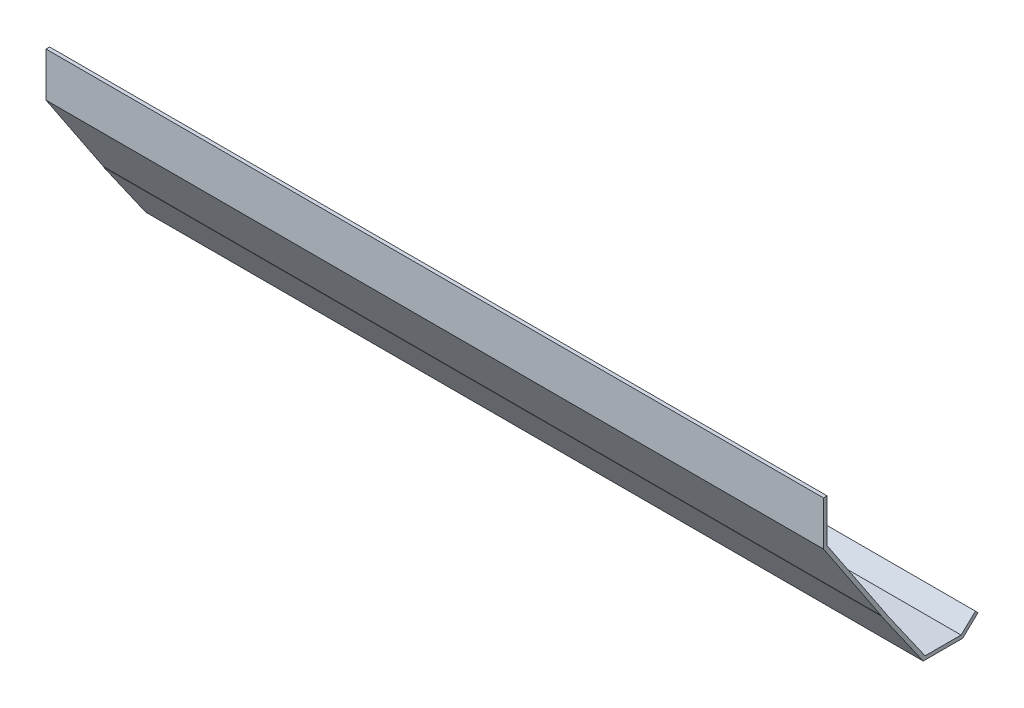
ISO-10303-21;
HEADER;
FILE_DESCRIPTION(('STEP AP214'),'2;1');
FILE_NAME('part.step','',(''),(''),'','','');
FILE_SCHEMA(('AUTOMOTIVE_DESIGN { 1 0 10303 214 1 1 1 1 }'));
ENDSEC;
DATA;
#1=APPLICATION_CONTEXT('core data for automotive mechanical design processes');
#2=APPLICATION_PROTOCOL_DEFINITION('international standard','automotive_design',2000,#1);
#3=PRODUCT_CONTEXT('',#1,'mechanical');
#4=PRODUCT('Part','Part','',(#3));
#5=PRODUCT_RELATED_PRODUCT_CATEGORY('part','',(#4));
#6=PRODUCT_DEFINITION_FORMATION('','',#4);
#7=PRODUCT_DEFINITION_CONTEXT('part definition',#1,'design');
#8=PRODUCT_DEFINITION('design','',#6,#7);
#9=PRODUCT_DEFINITION_SHAPE('','',#8);
#10=(LENGTH_UNIT() NAMED_UNIT(*) SI_UNIT(.MILLI.,.METRE.));
#11=(NAMED_UNIT(*) PLANE_ANGLE_UNIT() SI_UNIT($,.RADIAN.));
#12=(NAMED_UNIT(*) SI_UNIT($,.STERADIAN.) SOLID_ANGLE_UNIT());
#13=UNCERTAINTY_MEASURE_WITH_UNIT(LENGTH_MEASURE(1.E-05),#10,'distance_accuracy_value','');
#14=(GEOMETRIC_REPRESENTATION_CONTEXT(3) GLOBAL_UNCERTAINTY_ASSIGNED_CONTEXT((#13)) GLOBAL_UNIT_ASSIGNED_CONTEXT((#10,
#11,#12)) REPRESENTATION_CONTEXT('',''));
#15=CARTESIAN_POINT('',(0.,0.,0.));
#16=DIRECTION('',(0.,0.,1.));
#17=DIRECTION('',(1.,0.,0.));
#18=AXIS2_PLACEMENT_3D('',#15,#16,#17);
#19=CARTESIAN_POINT('',(685.8,0.,0.));
#20=DIRECTION('',(0.,-0.554700196225229,0.832050294337844));
#21=DIRECTION('',(0.,-0.832050294337844,-0.554700196225229));
#22=AXIS2_PLACEMENT_3D('',#19,#20,#21);
#23=PLANE('',#22);
#24=DIRECTION('',(0.,0.832050294337844,0.554700196225229));
#25=VECTOR('',#24,1.);
#26=CARTESIAN_POINT('',(0.,0.,0.));
#27=LINE('',#26,#25);
#28=CARTESIAN_POINT('',(0.,0.,0.));
#29=VERTEX_POINT('',#28);
#30=CARTESIAN_POINT('',(0.,76.2,50.8));
#31=VERTEX_POINT('',#30);
#32=EDGE_CURVE('E165',#29,#31,#27,.T.);
#33=ORIENTED_EDGE('',*,*,#32,.T.);
#34=DIRECTION('',(-1.,0.,0.));
#35=VECTOR('',#34,1.);
#36=CARTESIAN_POINT('',(685.8,76.2,50.8));
#37=LINE('',#36,#35);
#38=CARTESIAN_POINT('',(685.8,76.2,50.8));
#39=VERTEX_POINT('',#38);
#40=EDGE_CURVE('E11',#39,#31,#37,.T.);
#41=ORIENTED_EDGE('',*,*,#40,.F.);
#42=DIRECTION('',(0.,0.832050294337844,0.554700196225229));
#43=VECTOR('',#42,1.);
#44=CARTESIAN_POINT('',(685.8,0.,0.));
#45=LINE('',#44,#43);
#46=CARTESIAN_POINT('',(685.8,0.,0.));
#47=VERTEX_POINT('',#46);
#48=EDGE_CURVE('E191',#47,#39,#45,.T.);
#49=ORIENTED_EDGE('',*,*,#48,.F.);
#50=DIRECTION('',(-1.,0.,0.));
#51=VECTOR('',#50,1.);
#52=CARTESIAN_POINT('',(685.8,0.,0.));
#53=LINE('',#52,#51);
#54=EDGE_CURVE('E161',#47,#29,#53,.T.);
#55=ORIENTED_EDGE('',*,*,#54,.T.);
#56=EDGE_LOOP('',(#33,#41,#49,#55));
#57=FACE_BOUND('',#56,.T.);
#58=ADVANCED_FACE('F33',(#57),#23,.F.);
#59=CARTESIAN_POINT('',(685.8,76.2,50.8));
#60=DIRECTION('',(0.,0.,1.));
#61=DIRECTION('',(1.,0.,0.));
#62=AXIS2_PLACEMENT_3D('',#59,#60,#61);
#63=PLANE('',#62);
#64=DIRECTION('',(0.,1.,0.));
#65=VECTOR('',#64,1.);
#66=CARTESIAN_POINT('',(0.,76.2,50.8));
#67=LINE('',#66,#65);
#68=CARTESIAN_POINT('',(0.,114.3,50.8));
#69=VERTEX_POINT('',#68);
#70=EDGE_CURVE('E168',#31,#69,#67,.T.);
#71=ORIENTED_EDGE('',*,*,#70,.T.);
#72=DIRECTION('',(-1.,0.,0.));
#73=VECTOR('',#72,1.);
#74=CARTESIAN_POINT('',(685.8,114.3,50.8));
#75=LINE('',#74,#73);
#76=CARTESIAN_POINT('',(685.8,114.3,50.8));
#77=VERTEX_POINT('',#76);
#78=EDGE_CURVE('E41',#77,#69,#75,.T.);
#79=ORIENTED_EDGE('',*,*,#78,.F.);
#80=DIRECTION('',(0.,1.,0.));
#81=VECTOR('',#80,1.);
#82=CARTESIAN_POINT('',(685.8,76.2,50.8));
#83=LINE('',#82,#81);
#84=EDGE_CURVE('E110',#39,#77,#83,.T.);
#85=ORIENTED_EDGE('',*,*,#84,.F.);
#86=ORIENTED_EDGE('',*,*,#40,.T.);
#87=EDGE_LOOP('',(#71,#79,#85,#86));
#88=FACE_BOUND('',#87,.T.);
#89=ADVANCED_FACE('F279',(#88),#63,.F.);
#90=CARTESIAN_POINT('',(685.8,114.3,50.8));
#91=DIRECTION('',(0.,-1.,0.));
#92=DIRECTION('',(0.,0.,-1.));
#93=AXIS2_PLACEMENT_3D('',#90,#91,#92);
#94=PLANE('',#93);
#95=DIRECTION('',(0.,0.,1.));
#96=VECTOR('',#95,1.);
#97=CARTESIAN_POINT('',(0.,114.3,50.8));
#98=LINE('',#97,#96);
#99=CARTESIAN_POINT('',(0.,114.3,53.975));
#100=VERTEX_POINT('',#99);
#101=EDGE_CURVE('E170',#69,#100,#98,.T.);
#102=ORIENTED_EDGE('',*,*,#101,.T.);
#103=DIRECTION('',(-1.,0.,0.));
#104=VECTOR('',#103,1.);
#105=CARTESIAN_POINT('',(685.8,114.3,53.975));
#106=LINE('',#105,#104);
#107=CARTESIAN_POINT('',(685.8,114.3,53.975));
#108=VERTEX_POINT('',#107);
#109=EDGE_CURVE('E216',#108,#100,#106,.T.);
#110=ORIENTED_EDGE('',*,*,#109,.F.);
#111=DIRECTION('',(0.,0.,1.));
#112=VECTOR('',#111,1.);
#113=CARTESIAN_POINT('',(685.8,114.3,50.8));
#114=LINE('',#113,#112);
#115=EDGE_CURVE('E224',#77,#108,#114,.T.);
#116=ORIENTED_EDGE('',*,*,#115,.F.);
#117=ORIENTED_EDGE('',*,*,#78,.T.);
#118=EDGE_LOOP('',(#102,#110,#116,#117));
#119=FACE_BOUND('',#118,.T.);
#120=ADVANCED_FACE('F222',(#119),#94,.F.);
#121=CARTESIAN_POINT('',(685.8,114.3,53.975));
#122=DIRECTION('',(0.,0.,-1.));
#123=DIRECTION('',(0.,1.,0.));
#124=AXIS2_PLACEMENT_3D('',#121,#122,#123);
#125=PLANE('',#124);
#126=DIRECTION('',(0.,-1.,0.));
#127=VECTOR('',#126,1.);
#128=CARTESIAN_POINT('',(0.,114.3,53.975));
#129=LINE('',#128,#127);
#130=CARTESIAN_POINT('',(0.,75.2386873502009,53.975));
#131=VERTEX_POINT('',#130);
#132=EDGE_CURVE('E172',#100,#131,#129,.T.);
#133=ORIENTED_EDGE('',*,*,#132,.T.);
#134=DIRECTION('',(-1.,0.,0.));
#135=VECTOR('',#134,1.);
#136=CARTESIAN_POINT('',(685.8,75.2386873502009,53.975));
#137=LINE('',#136,#135);
#138=CARTESIAN_POINT('',(685.8,75.2386873502009,53.975));
#139=VERTEX_POINT('',#138);
#140=EDGE_CURVE('E213',#139,#131,#137,.T.);
#141=ORIENTED_EDGE('',*,*,#140,.F.);
#142=DIRECTION('',(0.,-1.,0.));
#143=VECTOR('',#142,1.);
#144=CARTESIAN_POINT('',(685.8,114.3,53.975));
#145=LINE('',#144,#143);
#146=EDGE_CURVE('E242',#108,#139,#145,.T.);
#147=ORIENTED_EDGE('',*,*,#146,.F.);
#148=ORIENTED_EDGE('',*,*,#109,.T.);
#149=EDGE_LOOP('',(#133,#141,#147,#148));
#150=FACE_BOUND('',#149,.T.);
#151=ADVANCED_FACE('F233',(#150),#125,.F.);
#152=CARTESIAN_POINT('',(685.8,75.2386873502009,53.975));
#153=DIRECTION('',(0.,0.554700196225229,-0.832050294337843));
#154=DIRECTION('',(0.,0.832050294337843,0.554700196225229));
#155=AXIS2_PLACEMENT_3D('',#152,#153,#154);
#156=PLANE('',#155);
#157=DIRECTION('',(0.,-0.832050294337843,-0.554700196225229));
#158=VECTOR('',#157,1.);
#159=CARTESIAN_POINT('',(0.,75.2386873502009,53.975));
#160=LINE('',#159,#158);
#161=CARTESIAN_POINT('',(0.,-0.961312649799054,3.17499999999998));
#162=VERTEX_POINT('',#161);
#163=EDGE_CURVE('E174',#131,#162,#160,.T.);
#164=ORIENTED_EDGE('',*,*,#163,.T.);
#165=DIRECTION('',(-1.,0.,0.));
#166=VECTOR('',#165,1.);
#167=CARTESIAN_POINT('',(685.8,-0.961312649799054,3.17499999999998));
#168=LINE('',#167,#166);
#169=CARTESIAN_POINT('',(685.8,-0.961312649799054,3.17499999999998));
#170=VERTEX_POINT('',#169);
#171=EDGE_CURVE('E210',#170,#162,#168,.T.);
#172=ORIENTED_EDGE('',*,*,#171,.F.);
#173=DIRECTION('',(0.,-0.832050294337843,-0.554700196225229));
#174=VECTOR('',#173,1.);
#175=CARTESIAN_POINT('',(685.8,75.2386873502009,53.975));
#176=LINE('',#175,#174);
#177=EDGE_CURVE('E239',#139,#170,#176,.T.);
#178=ORIENTED_EDGE('',*,*,#177,.F.);
#179=ORIENTED_EDGE('',*,*,#140,.T.);
#180=EDGE_LOOP('',(#164,#172,#178,#179));
#181=FACE_BOUND('',#180,.T.);
#182=ADVANCED_FACE('F237',(#181),#156,.F.);
#183=CARTESIAN_POINT('',(685.8,-0.961312649799054,3.17499999999998));
#184=DIRECTION('',(0.,0.,-1.));
#185=DIRECTION('',(0.,1.,0.));
#186=AXIS2_PLACEMENT_3D('',#183,#184,#185);
#187=PLANE('',#186);
#188=DIRECTION('',(0.,-1.,0.));
#189=VECTOR('',#188,1.);
#190=CARTESIAN_POINT('',(0.,-0.961312649799054,3.17499999999998));
#191=LINE('',#190,#189);
#192=CARTESIAN_POINT('',(0.,-1.25483058285066,3.17499999999999));
#193=VERTEX_POINT('',#192);
#194=EDGE_CURVE('E176',#162,#193,#191,.T.);
#195=ORIENTED_EDGE('',*,*,#194,.T.);
#196=DIRECTION('',(-1.,0.,0.));
#197=VECTOR('',#196,1.);
#198=CARTESIAN_POINT('',(685.8,-1.25483058285066,3.17499999999999));
#199=LINE('',#198,#197);
#200=CARTESIAN_POINT('',(685.8,-1.25483058285066,3.17499999999999));
#201=VERTEX_POINT('',#200);
#202=EDGE_CURVE('E207',#201,#193,#199,.T.);
#203=ORIENTED_EDGE('',*,*,#202,.F.);
#204=DIRECTION('',(0.,-1.,0.));
#205=VECTOR('',#204,1.);
#206=CARTESIAN_POINT('',(685.8,-0.961312649799054,3.17499999999998));
#207=LINE('',#206,#205);
#208=EDGE_CURVE('E241',#170,#201,#207,.T.);
#209=ORIENTED_EDGE('',*,*,#208,.F.);
#210=ORIENTED_EDGE('',*,*,#171,.T.);
#211=EDGE_LOOP('',(#195,#203,#209,#210));
#212=FACE_BOUND('',#211,.T.);
#213=ADVANCED_FACE('F292',(#212),#187,.F.);
#214=CARTESIAN_POINT('',(685.8,-1.25483058285066,3.17499999999999));
#215=DIRECTION('',(0.,0.573462344363328,-0.819231920519041));
#216=DIRECTION('',(0.,0.819231920519041,0.573462344363328));
#217=AXIS2_PLACEMENT_3D('',#214,#215,#216);
#218=PLANE('',#217);
#219=DIRECTION('',(0.,-0.81923192051904,-0.573462344363328));
#220=VECTOR('',#219,1.);
#221=CARTESIAN_POINT('',(0.,-1.25483058285066,3.17499999999999));
#222=LINE('',#221,#220);
#223=CARTESIAN_POINT('',(0.,-54.229,-33.9069185920045));
#224=VERTEX_POINT('',#223);
#225=EDGE_CURVE('E178',#193,#224,#222,.T.);
#226=ORIENTED_EDGE('',*,*,#225,.T.);
#227=DIRECTION('',(-1.,0.,0.));
#228=VECTOR('',#227,1.);
#229=CARTESIAN_POINT('',(685.8,-54.229,-33.9069185920045));
#230=LINE('',#229,#228);
#231=CARTESIAN_POINT('',(685.8,-54.229,-33.9069185920045));
#232=VERTEX_POINT('',#231);
#233=EDGE_CURVE('E204',#232,#224,#230,.T.);
#234=ORIENTED_EDGE('',*,*,#233,.F.);
#235=DIRECTION('',(0.,-0.81923192051904,-0.573462344363328));
#236=VECTOR('',#235,1.);
#237=CARTESIAN_POINT('',(685.8,-1.25483058285066,3.17499999999999));
#238=LINE('',#237,#236);
#239=EDGE_CURVE('E244',#201,#232,#238,.T.);
#240=ORIENTED_EDGE('',*,*,#239,.F.);
#241=ORIENTED_EDGE('',*,*,#202,.T.);
#242=EDGE_LOOP('',(#226,#234,#240,#241));
#243=FACE_BOUND('',#242,.T.);
#244=ADVANCED_FACE('F295',(#243),#218,.F.);
#245=CARTESIAN_POINT('',(685.8,-54.229,-33.9069185920045));
#246=DIRECTION('',(0.,1.,0.));
#247=DIRECTION('',(0.,0.,1.));
#248=AXIS2_PLACEMENT_3D('',#245,#246,#247);
#249=PLANE('',#248);
#250=DIRECTION('',(0.,0.,-1.));
#251=VECTOR('',#250,1.);
#252=CARTESIAN_POINT('',(0.,-54.229,-33.9069185920045));
#253=LINE('',#252,#251);
#254=CARTESIAN_POINT('',(0.,-54.229,-68.6637240911878));
#255=VERTEX_POINT('',#254);
#256=EDGE_CURVE('E180',#224,#255,#253,.T.);
#257=ORIENTED_EDGE('',*,*,#256,.T.);
#258=DIRECTION('',(-1.,0.,0.));
#259=VECTOR('',#258,1.);
#260=CARTESIAN_POINT('',(685.8,-54.229,-68.6637240911878));
#261=LINE('',#260,#259);
#262=CARTESIAN_POINT('',(685.8,-54.229,-68.6637240911878));
#263=VERTEX_POINT('',#262);
#264=EDGE_CURVE('E201',#263,#255,#261,.T.);
#265=ORIENTED_EDGE('',*,*,#264,.F.);
#266=DIRECTION('',(0.,0.,-1.));
#267=VECTOR('',#266,1.);
#268=CARTESIAN_POINT('',(685.8,-54.229,-33.9069185920045));
#269=LINE('',#268,#267);
#270=EDGE_CURVE('E250',#232,#263,#269,.T.);
#271=ORIENTED_EDGE('',*,*,#270,.F.);
#272=ORIENTED_EDGE('',*,*,#233,.T.);
#273=EDGE_LOOP('',(#257,#265,#271,#272));
#274=FACE_BOUND('',#273,.T.);
#275=ADVANCED_FACE('F299',(#274),#249,.F.);
#276=CARTESIAN_POINT('',(685.8,-54.229,-68.6637240911878));
#277=DIRECTION('',(0.,0.729942991089569,0.683508031963936));
#278=DIRECTION('',(0.,-0.683508031963936,0.729942991089569));
#279=AXIS2_PLACEMENT_3D('',#276,#277,#278);
#280=PLANE('',#279);
#281=DIRECTION('',(0.,0.683508031963936,-0.729942991089569));
#282=VECTOR('',#281,1.);
#283=CARTESIAN_POINT('',(0.,-54.229,-68.6637240911878));
#284=LINE('',#283,#282);
#285=CARTESIAN_POINT('',(0.,-41.529,-82.2265142170055));
#286=VERTEX_POINT('',#285);
#287=EDGE_CURVE('E182',#255,#286,#284,.T.);
#288=ORIENTED_EDGE('',*,*,#287,.T.);
#289=DIRECTION('',(-1.,0.,0.));
#290=VECTOR('',#289,1.);
#291=CARTESIAN_POINT('',(685.8,-41.529,-82.2265142170055));
#292=LINE('',#291,#290);
#293=CARTESIAN_POINT('',(685.8,-41.529,-82.2265142170055));
#294=VERTEX_POINT('',#293);
#295=EDGE_CURVE('E198',#294,#286,#292,.T.);
#296=ORIENTED_EDGE('',*,*,#295,.F.);
#297=DIRECTION('',(0.,0.683508031963936,-0.729942991089569));
#298=VECTOR('',#297,1.);
#299=CARTESIAN_POINT('',(685.8,-54.229,-68.6637240911878));
#300=LINE('',#299,#298);
#301=EDGE_CURVE('E252',#263,#294,#300,.T.);
#302=ORIENTED_EDGE('',*,*,#301,.F.);
#303=ORIENTED_EDGE('',*,*,#264,.T.);
#304=EDGE_LOOP('',(#288,#296,#302,#303));
#305=FACE_BOUND('',#304,.T.);
#306=ADVANCED_FACE('F303',(#305),#280,.F.);
#307=CARTESIAN_POINT('',(685.8,-41.529,-82.2265142170055));
#308=DIRECTION('',(0.,-0.683508031963937,0.729942991089568));
#309=DIRECTION('',(0.,-0.729942991089568,-0.683508031963937));
#310=AXIS2_PLACEMENT_3D('',#307,#308,#309);
#311=PLANE('',#310);
#312=DIRECTION('',(0.,0.729942991089568,0.683508031963937));
#313=VECTOR('',#312,1.);
#314=CARTESIAN_POINT('',(0.,-41.529,-82.2265142170055));
#315=LINE('',#314,#313);
#316=CARTESIAN_POINT('',(0.,-39.161904162509,-80.01));
#317=VERTEX_POINT('',#316);
#318=EDGE_CURVE('E184',#286,#317,#315,.T.);
#319=ORIENTED_EDGE('',*,*,#318,.T.);
#320=DIRECTION('',(-1.,0.,0.));
#321=VECTOR('',#320,1.);
#322=CARTESIAN_POINT('',(685.8,-39.161904162509,-80.01));
#323=LINE('',#322,#321);
#324=CARTESIAN_POINT('',(685.8,-39.161904162509,-80.01));
#325=VERTEX_POINT('',#324);
#326=EDGE_CURVE('E195',#325,#317,#323,.T.);
#327=ORIENTED_EDGE('',*,*,#326,.F.);
#328=DIRECTION('',(0.,0.729942991089568,0.683508031963937));
#329=VECTOR('',#328,1.);
#330=CARTESIAN_POINT('',(685.8,-41.529,-82.2265142170055));
#331=LINE('',#330,#329);
#332=EDGE_CURVE('E254',#294,#325,#331,.T.);
#333=ORIENTED_EDGE('',*,*,#332,.F.);
#334=ORIENTED_EDGE('',*,*,#295,.T.);
#335=EDGE_LOOP('',(#319,#327,#333,#334));
#336=FACE_BOUND('',#335,.T.);
#337=ADVANCED_FACE('F260',(#336),#311,.F.);
#338=CARTESIAN_POINT('',(685.8,-39.161904162509,-80.01));
#339=DIRECTION('',(0.,-0.729942991089569,-0.683508031963936));
#340=DIRECTION('',(0.,0.683508031963936,-0.729942991089569));
#341=AXIS2_PLACEMENT_3D('',#338,#339,#340);
#342=PLANE('',#341);
#343=DIRECTION('',(0.,-0.683508031963936,0.729942991089569));
#344=VECTOR('',#343,1.);
#345=CARTESIAN_POINT('',(0.,-39.161904162509,-80.01));
#346=LINE('',#345,#344);
#347=CARTESIAN_POINT('',(0.,-51.054,-67.31));
#348=VERTEX_POINT('',#347);
#349=EDGE_CURVE('E186',#317,#348,#346,.T.);
#350=ORIENTED_EDGE('',*,*,#349,.T.);
#351=DIRECTION('',(-1.,0.,0.));
#352=VECTOR('',#351,1.);
#353=CARTESIAN_POINT('',(685.8,-51.054,-67.31));
#354=LINE('',#353,#352);
#355=CARTESIAN_POINT('',(685.8,-51.054,-67.31));
#356=VERTEX_POINT('',#355);
#357=EDGE_CURVE('E156',#356,#348,#354,.T.);
#358=ORIENTED_EDGE('',*,*,#357,.F.);
#359=DIRECTION('',(0.,-0.683508031963936,0.729942991089569));
#360=VECTOR('',#359,1.);
#361=CARTESIAN_POINT('',(685.8,-39.161904162509,-80.01));
#362=LINE('',#361,#360);
#363=EDGE_CURVE('E147',#325,#356,#362,.T.);
#364=ORIENTED_EDGE('',*,*,#363,.F.);
#365=ORIENTED_EDGE('',*,*,#326,.T.);
#366=EDGE_LOOP('',(#350,#358,#364,#365));
#367=FACE_BOUND('',#366,.T.);
#368=ADVANCED_FACE('F264',(#367),#342,.F.);
#369=CARTESIAN_POINT('',(685.8,-51.054,-67.31));
#370=DIRECTION('',(0.,-1.,0.));
#371=DIRECTION('',(0.,0.,-1.));
#372=AXIS2_PLACEMENT_3D('',#369,#370,#371);
#373=PLANE('',#372);
#374=DIRECTION('',(0.,0.,1.));
#375=VECTOR('',#374,1.);
#376=CARTESIAN_POINT('',(0.,-51.054,-67.31));
#377=LINE('',#376,#375);
#378=CARTESIAN_POINT('',(0.,-51.054,-35.56));
#379=VERTEX_POINT('',#378);
#380=EDGE_CURVE('E155',#348,#379,#377,.T.);
#381=ORIENTED_EDGE('',*,*,#380,.T.);
#382=DIRECTION('',(-1.,0.,0.));
#383=VECTOR('',#382,1.);
#384=CARTESIAN_POINT('',(685.8,-51.054,-35.56));
#385=LINE('',#384,#383);
#386=CARTESIAN_POINT('',(685.8,-51.054,-35.56));
#387=VERTEX_POINT('',#386);
#388=EDGE_CURVE('E152',#387,#379,#385,.T.);
#389=ORIENTED_EDGE('',*,*,#388,.F.);
#390=DIRECTION('',(0.,0.,1.));
#391=VECTOR('',#390,1.);
#392=CARTESIAN_POINT('',(685.8,-51.054,-67.31));
#393=LINE('',#392,#391);
#394=EDGE_CURVE('E141',#356,#387,#393,.T.);
#395=ORIENTED_EDGE('',*,*,#394,.F.);
#396=ORIENTED_EDGE('',*,*,#357,.T.);
#397=EDGE_LOOP('',(#381,#389,#395,#396));
#398=FACE_BOUND('',#397,.T.);
#399=ADVANCED_FACE('F153',(#398),#373,.F.);
#400=CARTESIAN_POINT('',(685.8,-51.054,-35.56));
#401=DIRECTION('',(0.,-0.573462344363328,0.819231920519041));
#402=DIRECTION('',(0.,-0.819231920519041,-0.573462344363328));
#403=AXIS2_PLACEMENT_3D('',#400,#401,#402);
#404=PLANE('',#403);
#405=DIRECTION('',(0.,0.819231920519041,0.573462344363328));
#406=VECTOR('',#405,1.);
#407=CARTESIAN_POINT('',(0.,-51.054,-35.56));
#408=LINE('',#407,#406);
#409=CARTESIAN_POINT('',(0.,-0.254000000000001,0.));
#410=VERTEX_POINT('',#409);
#411=EDGE_CURVE('E96',#379,#410,#408,.T.);
#412=ORIENTED_EDGE('',*,*,#411,.T.);
#413=DIRECTION('',(-1.,0.,0.));
#414=VECTOR('',#413,1.);
#415=CARTESIAN_POINT('',(685.8,-0.254000000000001,0.));
#416=LINE('',#415,#414);
#417=CARTESIAN_POINT('',(685.8,-0.254000000000001,0.));
#418=VERTEX_POINT('',#417);
#419=EDGE_CURVE('E157',#418,#410,#416,.T.);
#420=ORIENTED_EDGE('',*,*,#419,.F.);
#421=DIRECTION('',(0.,0.819231920519041,0.573462344363328));
#422=VECTOR('',#421,1.);
#423=CARTESIAN_POINT('',(685.8,-51.054,-35.56));
#424=LINE('',#423,#422);
#425=EDGE_CURVE('E145',#387,#418,#424,.T.);
#426=ORIENTED_EDGE('',*,*,#425,.F.);
#427=ORIENTED_EDGE('',*,*,#388,.T.);
#428=EDGE_LOOP('',(#412,#420,#426,#427));
#429=FACE_BOUND('',#428,.T.);
#430=ADVANCED_FACE('F159',(#429),#404,.F.);
#431=CARTESIAN_POINT('',(685.8,-0.254000000000001,0.));
#432=DIRECTION('',(0.,0.,1.));
#433=DIRECTION('',(1.,0.,0.));
#434=AXIS2_PLACEMENT_3D('',#431,#432,#433);
#435=PLANE('',#434);
#436=DIRECTION('',(0.,1.,0.));
#437=VECTOR('',#436,1.);
#438=CARTESIAN_POINT('',(0.,-0.254000000000001,0.));
#439=LINE('',#438,#437);
#440=EDGE_CURVE('E102',#410,#29,#439,.T.);
#441=ORIENTED_EDGE('',*,*,#440,.T.);
#442=ORIENTED_EDGE('',*,*,#54,.F.);
#443=DIRECTION('',(0.,1.,0.));
#444=VECTOR('',#443,1.);
#445=CARTESIAN_POINT('',(685.8,-0.254000000000001,0.));
#446=LINE('',#445,#444);
#447=EDGE_CURVE('E49',#418,#47,#446,.T.);
#448=ORIENTED_EDGE('',*,*,#447,.F.);
#449=ORIENTED_EDGE('',*,*,#419,.T.);
#450=EDGE_LOOP('',(#441,#442,#448,#449));
#451=FACE_BOUND('',#450,.T.);
#452=ADVANCED_FACE('F268',(#451),#435,.F.);
#453=CARTESIAN_POINT('',(685.8,0.,0.));
#454=DIRECTION('',(-1.,0.,0.));
#455=DIRECTION('',(0.,0.,1.));
#456=AXIS2_PLACEMENT_3D('',#453,#454,#455);
#457=PLANE('',#456);
#458=ORIENTED_EDGE('',*,*,#48,.T.);
#459=ORIENTED_EDGE('',*,*,#84,.T.);
#460=ORIENTED_EDGE('',*,*,#115,.T.);
#461=ORIENTED_EDGE('',*,*,#146,.T.);
#462=ORIENTED_EDGE('',*,*,#177,.T.);
#463=ORIENTED_EDGE('',*,*,#208,.T.);
#464=ORIENTED_EDGE('',*,*,#239,.T.);
#465=ORIENTED_EDGE('',*,*,#270,.T.);
#466=ORIENTED_EDGE('',*,*,#301,.T.);
#467=ORIENTED_EDGE('',*,*,#332,.T.);
#468=ORIENTED_EDGE('',*,*,#363,.T.);
#469=ORIENTED_EDGE('',*,*,#394,.T.);
#470=ORIENTED_EDGE('',*,*,#425,.T.);
#471=ORIENTED_EDGE('',*,*,#447,.T.);
#472=EDGE_LOOP('',(#458,#459,#460,#461,#462,#463,#464,#465,#466,#467,#468,#469,#470,#471));
#473=FACE_BOUND('',#472,.T.);
#474=ADVANCED_FACE('F143',(#473),#457,.F.);
#475=CARTESIAN_POINT('',(0.,0.,0.));
#476=DIRECTION('',(-1.,0.,0.));
#477=DIRECTION('',(0.,0.,1.));
#478=AXIS2_PLACEMENT_3D('',#475,#476,#477);
#479=PLANE('',#478);
#480=ORIENTED_EDGE('',*,*,#32,.F.);
#481=ORIENTED_EDGE('',*,*,#440,.F.);
#482=ORIENTED_EDGE('',*,*,#411,.F.);
#483=ORIENTED_EDGE('',*,*,#380,.F.);
#484=ORIENTED_EDGE('',*,*,#349,.F.);
#485=ORIENTED_EDGE('',*,*,#318,.F.);
#486=ORIENTED_EDGE('',*,*,#287,.F.);
#487=ORIENTED_EDGE('',*,*,#256,.F.);
#488=ORIENTED_EDGE('',*,*,#225,.F.);
#489=ORIENTED_EDGE('',*,*,#194,.F.);
#490=ORIENTED_EDGE('',*,*,#163,.F.);
#491=ORIENTED_EDGE('',*,*,#132,.F.);
#492=ORIENTED_EDGE('',*,*,#101,.F.);
#493=ORIENTED_EDGE('',*,*,#70,.F.);
#494=EDGE_LOOP('',(#480,#481,#482,#483,#484,#485,#486,#487,#488,#489,#490,#491,#492,#493));
#495=FACE_BOUND('',#494,.T.);
#496=ADVANCED_FACE('F228',(#495),#479,.T.);
#497=CLOSED_SHELL('',(#58,#89,#120,#151,#182,#213,#244,#275,#306,#337,#368,#399,#430,#452,#474,#496));
#498=MANIFOLD_SOLID_BREP('B2',#497);
#499=ADVANCED_BREP_SHAPE_REPRESENTATION('',(#18,#498),#14);
#500=SHAPE_DEFINITION_REPRESENTATION(#9,#499);
ENDSEC;
END-ISO-10303-21;
